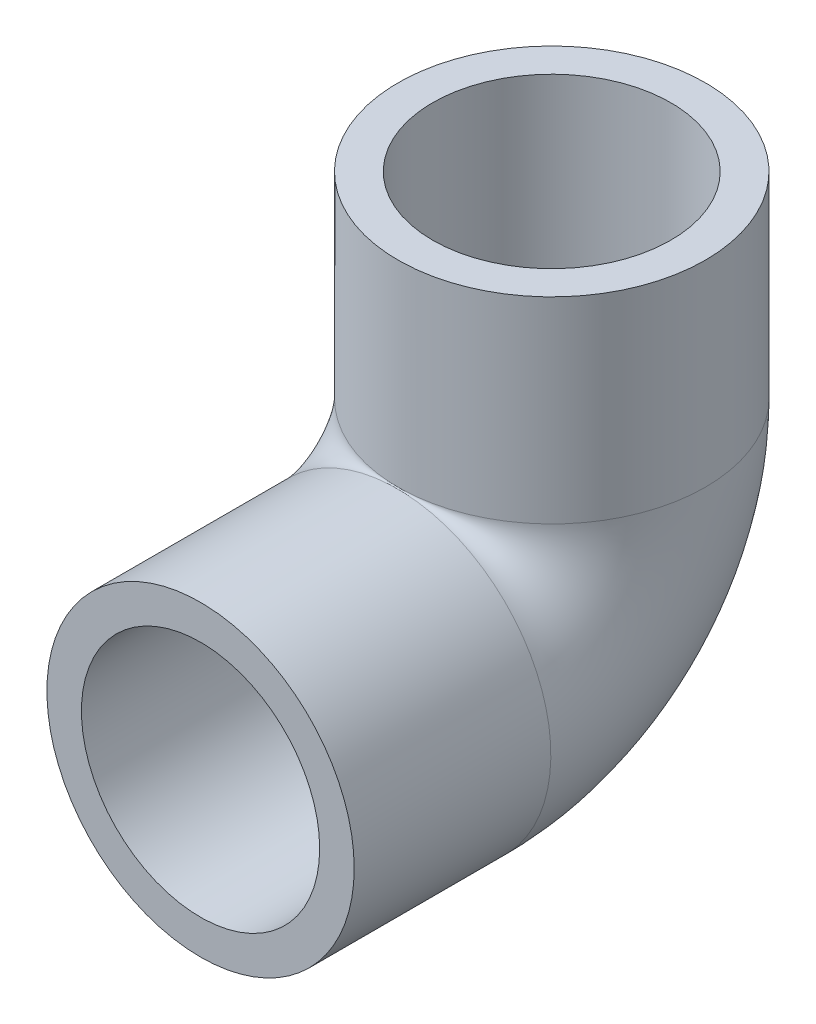
ISO-10303-21;
HEADER;
FILE_DESCRIPTION(('STEP AP214'),'2;1');
FILE_NAME('part.step','',(''),(''),'','','');
FILE_SCHEMA(('AUTOMOTIVE_DESIGN { 1 0 10303 214 1 1 1 1 }'));
ENDSEC;
DATA;
#1=APPLICATION_CONTEXT('core data for automotive mechanical design processes');
#2=APPLICATION_PROTOCOL_DEFINITION('international standard','automotive_design',2000,#1);
#3=PRODUCT_CONTEXT('',#1,'mechanical');
#4=PRODUCT('Part','Part','',(#3));
#5=PRODUCT_RELATED_PRODUCT_CATEGORY('part','',(#4));
#6=PRODUCT_DEFINITION_FORMATION('','',#4);
#7=PRODUCT_DEFINITION_CONTEXT('part definition',#1,'design');
#8=PRODUCT_DEFINITION('design','',#6,#7);
#9=PRODUCT_DEFINITION_SHAPE('','',#8);
#10=(LENGTH_UNIT() NAMED_UNIT(*) SI_UNIT(.MILLI.,.METRE.));
#11=(NAMED_UNIT(*) PLANE_ANGLE_UNIT() SI_UNIT($,.RADIAN.));
#12=(NAMED_UNIT(*) SI_UNIT($,.STERADIAN.) SOLID_ANGLE_UNIT());
#13=UNCERTAINTY_MEASURE_WITH_UNIT(LENGTH_MEASURE(1.E-05),#10,'distance_accuracy_value','');
#14=(GEOMETRIC_REPRESENTATION_CONTEXT(3) GLOBAL_UNCERTAINTY_ASSIGNED_CONTEXT((#13)) GLOBAL_UNIT_ASSIGNED_CONTEXT((#10,
#11,#12)) REPRESENTATION_CONTEXT('',''));
#15=CARTESIAN_POINT('',(0.,0.,0.));
#16=DIRECTION('',(0.,0.,1.));
#17=DIRECTION('',(1.,0.,0.));
#18=AXIS2_PLACEMENT_3D('',#15,#16,#17);
#19=CARTESIAN_POINT('',(0.,13.97,-17.78));
#20=DIRECTION('',(1.,0.,0.));
#21=DIRECTION('',(0.,0.,-1.));
#22=AXIS2_PLACEMENT_3D('',#19,#20,#21);
#23=TOROIDAL_SURFACE('',#22,13.97,8.89);
#24=CARTESIAN_POINT('',(-6.37844074945994,-6.15250620204619,-19.05));
#25=CARTESIAN_POINT('',(-6.55265358811134,-5.97270897004341,-19.05));
#26=CARTESIAN_POINT('',(-6.71924963325663,-5.78557069902349,-19.05));
#27=CARTESIAN_POINT('',(-7.036126640922,-5.39785408510035,-19.05));
#28=CARTESIAN_POINT('',(-7.18640319357505,-5.1972721329966,-19.05));
#29=CARTESIAN_POINT('',(-7.4696691497037,-4.78393540811667,-19.05));
#30=CARTESIAN_POINT('',(-7.60263955128776,-4.57116761836567,-19.05));
#31=CARTESIAN_POINT('',(-7.85017068423849,-4.13517535821175,-19.05));
#32=CARTESIAN_POINT('',(-7.96473115637433,-3.91195074062304,-19.05));
#33=CARTESIAN_POINT('',(-8.17457283771716,-3.45678497671088,-19.05));
#34=CARTESIAN_POINT('',(-8.26986592369114,-3.22484930524622,-19.05));
#35=CARTESIAN_POINT('',(-8.44060317279692,-2.75378003626996,-19.05));
#36=CARTESIAN_POINT('',(-8.5160470252719,-2.51464632616842,-19.05));
#37=CARTESIAN_POINT('',(-8.64653958838355,-2.0309899566447,-19.05));
#38=CARTESIAN_POINT('',(-8.70159716753797,-1.78646968966845,-19.05));
#39=CARTESIAN_POINT('',(-8.79101136260539,-1.29358617762446,-19.05));
#40=CARTESIAN_POINT('',(-8.82536079059621,-1.04522162882963,-19.05));
#41=CARTESIAN_POINT('',(-8.87316358347558,-0.545932697635167,-19.05));
#42=CARTESIAN_POINT('',(-8.88657032999845,-0.295003852305892,-19.05));
#43=CARTESIAN_POINT('',(-8.8922734770001,0.20709782060306,-19.05));
#44=CARTESIAN_POINT('',(-8.88456944479688,0.458270653077971,-19.05));
#45=CARTESIAN_POINT('',(-8.84813304169755,0.959094117650891,-19.05));
#46=CARTESIAN_POINT('',(-8.81939996889569,1.20874469865884,-19.05));
#47=CARTESIAN_POINT('',(-8.74113697253112,1.70476976699208,-19.05));
#48=CARTESIAN_POINT('',(-8.69160651997203,1.95114417082098,-19.05));
#49=CARTESIAN_POINT('',(-8.57185451013886,2.44000702483937,-19.05));
#50=CARTESIAN_POINT('',(-8.50153935408703,2.68247254800679,-19.05));
#51=CARTESIAN_POINT('',(-8.34080660892054,3.16073310754644,-19.05));
#52=CARTESIAN_POINT('',(-8.25038247233881,3.39652594304511,-19.05));
#53=CARTESIAN_POINT('',(-8.05012647106405,3.85967984029267,-19.05));
#54=CARTESIAN_POINT('',(-7.94029739824587,4.08704210929917,-19.05));
#55=CARTESIAN_POINT('',(-7.70201980419061,4.53179156443763,-19.05));
#56=CARTESIAN_POINT('',(-7.57357116501662,4.74917868737522,-19.05));
#57=CARTESIAN_POINT('',(-7.29811067153746,5.17380045370301,-19.05));
#58=CARTESIAN_POINT('',(-7.150987300397,5.38096276182464,-19.05));
#59=CARTESIAN_POINT('',(-6.83991870902255,5.78214057197237,-19.05));
#60=CARTESIAN_POINT('',(-6.67597886392806,5.97616024213086,-19.05));
#61=CARTESIAN_POINT('',(-6.33234691783932,6.34980727003259,-19.05));
#62=CARTESIAN_POINT('',(-6.15265054487344,6.5294306991874,-19.05));
#63=CARTESIAN_POINT('',(-5.77880097090272,6.87293620301891,-19.05));
#64=CARTESIAN_POINT('',(-5.58464810212479,7.03681863924366,-19.05));
#65=CARTESIAN_POINT('',(-5.18258024855418,7.34814123361896,-19.05));
#66=CARTESIAN_POINT('',(-4.97462322043498,7.49552710854928,-19.05));
#67=CARTESIAN_POINT('',(-4.54695287018983,7.77211184423889,-19.05));
#68=CARTESIAN_POINT('',(-4.32723990730704,7.90131126031062,-19.05));
#69=CARTESIAN_POINT('',(-3.87754569675702,8.1404939788153,-19.05));
#70=CARTESIAN_POINT('',(-3.6475629283226,8.25047442334923,-19.05));
#71=CARTESIAN_POINT('',(-3.17907398707908,8.45019120132642,-19.05));
#72=CARTESIAN_POINT('',(-2.94057134415004,8.53993580855791,-19.05));
#73=CARTESIAN_POINT('',(-2.45987084940879,8.69733663913599,-19.05));
#74=CARTESIAN_POINT('',(-2.21776345883891,8.76526904414771,-19.05));
#75=CARTESIAN_POINT('',(-1.72858098729408,8.87996111423802,-19.05));
#76=CARTESIAN_POINT('',(-1.48150595985033,8.92672100734367,-19.05));
#77=CARTESIAN_POINT('',(-0.984285212546029,8.99855256067346,-19.05));
#78=CARTESIAN_POINT('',(-0.734140301182061,9.02362981207311,-19.05));
#79=CARTESIAN_POINT('',(-0.232617894754403,9.05182982779911,-19.05));
#80=CARTESIAN_POINT('',(0.018759571860313,9.054953096487,-19.05));
#81=CARTESIAN_POINT('',(0.513353804620188,9.03944560482782,-19.05));
#82=CARTESIAN_POINT('',(0.756591027849455,9.02145875112137,-19.05));
#83=CARTESIAN_POINT('',(1.24066784103208,8.96498140671673,-19.05));
#84=CARTESIAN_POINT('',(1.48150747679653,8.92649130854625,-19.05));
#85=CARTESIAN_POINT('',(1.95907619949638,8.82941171345989,-19.05));
#86=CARTESIAN_POINT('',(2.19580561370827,8.7708238246136,-19.05));
#87=CARTESIAN_POINT('',(2.66364052660021,8.63409328400183,-19.05));
#88=CARTESIAN_POINT('',(2.89474386168033,8.55594323567732,-19.05));
#89=CARTESIAN_POINT('',(3.35016692003279,8.3806217818884,-19.05));
#90=CARTESIAN_POINT('',(3.57447152643576,8.28341113294343,-19.05));
#91=CARTESIAN_POINT('',(4.0144087358547,8.0708447322389,-19.05));
#92=CARTESIAN_POINT('',(4.23003811332067,7.95548230831805,-19.05));
#93=CARTESIAN_POINT('',(4.65108292851164,7.70757175378529,-19.05));
#94=CARTESIAN_POINT('',(4.85650164906419,7.57502919685121,-19.05));
#95=CARTESIAN_POINT('',(5.25597905150216,7.29363102751744,-19.05));
#96=CARTESIAN_POINT('',(5.45003252152679,7.144768019393,-19.05));
#97=CARTESIAN_POINT('',(5.83100867687358,6.82716794535048,-19.05));
#98=CARTESIAN_POINT('',(6.01754953209855,6.65797259770887,-19.05));
#99=CARTESIAN_POINT('',(6.37581926745785,6.30471539210296,-19.05));
#100=CARTESIAN_POINT('',(6.54755437928516,6.12065985254199,-19.05));
#101=CARTESIAN_POINT('',(6.87519507790134,5.73881857616719,-19.05));
#102=CARTESIAN_POINT('',(7.03109363309841,5.54102680538322,-19.05));
#103=CARTESIAN_POINT('',(7.32583667873847,5.13322537015793,-19.05));
#104=CARTESIAN_POINT('',(7.46468704196691,4.92321995003754,-19.05));
#105=CARTESIAN_POINT('',(7.72600879668106,4.48973454552875,-19.05));
#106=CARTESIAN_POINT('',(7.84825882848079,4.26612106176459,-19.05));
#107=CARTESIAN_POINT('',(8.07344693594014,3.8093762938715,-19.05));
#108=CARTESIAN_POINT('',(8.17638525534277,3.5762451299153,-19.05));
#109=CARTESIAN_POINT('',(8.36218859933833,3.10210862147539,-19.05));
#110=CARTESIAN_POINT('',(8.44505313408284,2.86110308500096,-19.05));
#111=CARTESIAN_POINT('',(8.59007655851628,2.37294516206827,-19.05));
#112=CARTESIAN_POINT('',(8.65223588785182,2.12579290624693,-19.05));
#113=CARTESIAN_POINT('',(8.75521024407407,1.6278799019722,-19.05));
#114=CARTESIAN_POINT('',(8.79609083571064,1.37713271369474,-19.05));
#115=CARTESIAN_POINT('',(8.85646205137526,0.873165387976139,-19.05));
#116=CARTESIAN_POINT('',(8.87596023919226,0.619946156992454,-19.05));
#117=CARTESIAN_POINT('',(8.89342225171104,0.112726527647214,-19.05));
#118=CARTESIAN_POINT('',(8.89138276368565,-0.141273984877296,-19.05));
#119=CARTESIAN_POINT('',(8.86574700201337,-0.648184928173761,-19.05));
#120=CARTESIAN_POINT('',(8.84215082340086,-0.901095363746468,-19.05));
#121=CARTESIAN_POINT('',(8.77375583078849,-1.4024593494625,-19.05));
#122=CARTESIAN_POINT('',(8.72908732816365,-1.65093068201252,-19.05));
#123=CARTESIAN_POINT('',(8.61889563933159,-2.14320488925253,-19.05));
#124=CARTESIAN_POINT('',(8.55337256671114,-2.38700778936201,-19.05));
#125=CARTESIAN_POINT('',(8.4019227474812,-2.86818683650978,-19.05));
#126=CARTESIAN_POINT('',(8.31599639652777,-3.10556310807248,-19.05));
#127=CARTESIAN_POINT('',(8.12433901929039,-3.57218140863061,-19.05));
#128=CARTESIAN_POINT('',(8.01860804283899,-3.80142345809171,-19.05));
#129=CARTESIAN_POINT('',(7.7886502619659,-4.249020832057,-19.05));
#130=CARTESIAN_POINT('',(7.66451620317844,-4.46742381037555,-19.05));
#131=CARTESIAN_POINT('',(7.39820215299085,-4.89304158433434,-19.05));
#132=CARTESIAN_POINT('',(7.25601593671676,-5.10025248534216,-19.05));
#133=CARTESIAN_POINT('',(6.9546673064269,-5.50187538709932,-19.05));
#134=CARTESIAN_POINT('',(6.79550821560564,-5.69628988130267,-19.05));
#135=CARTESIAN_POINT('',(6.46131821985327,-6.07096912852214,-19.05));
#136=CARTESIAN_POINT('',(6.28628702440131,-6.25123362242587,-19.05));
#137=CARTESIAN_POINT('',(5.9221582378114,-6.59578453294764,-19.05));
#138=CARTESIAN_POINT('',(5.73310507894826,-6.76011790897933,-19.05));
#139=CARTESIAN_POINT('',(5.3418040006315,-7.07225156348138,-19.05));
#140=CARTESIAN_POINT('',(5.13955583215232,-7.22005152977852,-19.05));
#141=CARTESIAN_POINT('',(4.72331005112464,-7.4980521459467,-19.05));
#142=CARTESIAN_POINT('',(4.50931262725675,-7.6282530783234,-19.05));
#143=CARTESIAN_POINT('',(4.07108987538269,-7.87012379351695,-19.05));
#144=CARTESIAN_POINT('',(3.84686456269063,-7.9817936040791,-19.05));
#145=CARTESIAN_POINT('',(3.39018408282369,-8.18562219347568,-19.05));
#146=CARTESIAN_POINT('',(3.15774395393405,-8.27781466717863,-19.05));
#147=CARTESIAN_POINT('',(2.68592346418781,-8.44227227142287,-19.05));
#148=CARTESIAN_POINT('',(2.44654325734194,-8.51453784379845,-19.05));
#149=CARTESIAN_POINT('',(1.96254739975653,-8.63862526577819,-19.05));
#150=CARTESIAN_POINT('',(1.71793187029656,-8.6904475884239,-19.05));
#151=CARTESIAN_POINT('',(1.22520727081707,-8.77327878407377,-19.05));
#152=CARTESIAN_POINT('',(0.977098276439946,-8.8042881070268,-19.05));
#153=CARTESIAN_POINT('',(0.479350065306444,-8.84525639351295,-19.05));
#154=CARTESIAN_POINT('',(0.229712244545157,-8.85523231932335,-19.05));
#155=CARTESIAN_POINT('',(-0.269429523398658,-8.85411317088767,-19.05));
#156=CARTESIAN_POINT('',(-0.518933486985621,-8.84302540228637,-19.05));
#157=CARTESIAN_POINT('',(-1.0162277586702,-8.79986321521925,-19.05));
#158=CARTESIAN_POINT('',(-1.26401728343827,-8.76777977101511,-19.05));
#159=CARTESIAN_POINT('',(-1.75600745580795,-8.68284773649598,-19.05));
#160=CARTESIAN_POINT('',(-2.00020816039615,-8.62999947627432,-19.05));
#161=CARTESIAN_POINT('',(-2.48336396148331,-8.50389590252119,-19.05));
#162=CARTESIAN_POINT('',(-2.72231740052259,-8.43063423823628,-19.05));
#163=CARTESIAN_POINT('',(-3.19319699310001,-8.26423683857388,-19.05));
#164=CARTESIAN_POINT('',(-3.42512322920915,-8.17110133682135,-19.05));
#165=CARTESIAN_POINT('',(-3.88006187865779,-7.96572938994331,-19.05));
#166=CARTESIAN_POINT('',(-4.10308362283978,-7.85351362381503,-19.05));
#167=CARTESIAN_POINT('',(-4.53882480249673,-7.61075693695441,-19.05));
#168=CARTESIAN_POINT('',(-4.75154695631042,-7.48022088728832,-19.05));
#169=CARTESIAN_POINT('',(-5.21487975933969,-7.16831067332331,-19.05));
#170=CARTESIAN_POINT('',(-5.4623537840472,-6.98225002895641,-19.05));
#171=CARTESIAN_POINT('',(-5.93657033226603,-6.58535970375744,-19.05));
#172=CARTESIAN_POINT('',(-6.16331285507396,-6.37453002208499,-19.05));
#173=CARTESIAN_POINT('',(-6.37844074945994,-6.15250620204619,-19.05));
#174=B_SPLINE_CURVE_WITH_KNOTS('',3,(#24,#25,#26,#27,#28,#29,#30,#31,#32,#33,#34,#35,#36,#37,
#38,#39,#40,#41,#42,#43,#44,#45,#46,#47,#48,#49,#50,#51,#52,#53,#54,#55,#56,#57,#58,#59,#60,#61,
#62,#63,#64,#65,#66,#67,#68,#69,#70,#71,#72,#73,#74,#75,#76,#77,#78,#79,#80,#81,#82,#83,#84,#85,
#86,#87,#88,#89,#90,#91,#92,#93,#94,#95,#96,#97,#98,#99,#100,#101,#102,#103,#104,#105,#106,#107,
#108,#109,#110,#111,#112,#113,#114,#115,#116,#117,#118,#119,#120,#121,#122,#123,#124,#125,#126,
#127,#128,#129,#130,#131,#132,#133,#134,#135,#136,#137,#138,#139,#140,#141,#142,#143,#144,#145,
#146,#147,#148,#149,#150,#151,#152,#153,#154,#155,#156,#157,#158,#159,#160,#161,#162,#163,#164,
#165,#166,#167,#168,#169,#170,#171,#172,#173),.UNSPECIFIED.,.T.,.F.,(4,2,2,2,2,2,2,2,2,2,2,2,2,
2,2,2,2,2,2,2,2,2,2,2,2,2,2,2,2,2,2,2,2,2,2,2,2,2,2,2,2,2,2,2,2,2,2,2,2,2,2,2,2,2,2,2,2,2,2,2,2,
2,2,2,2,2,2,2,2,2,2,2,2,2,4),(0.,0.750790938646044,1.50178425445916,2.25359531544322,
3.00541696177633,3.75677374914059,4.50814229515696,5.25918359274094,6.01048543134633,
6.7634572951457,7.5164445918104,8.26945702277473,9.02248860831486,9.77896433391011,
10.5356867289291,11.292300339442,12.0489187425777,12.8102889616309,13.5714165737231,
14.3327511875942,15.0940683105167,15.8578212031448,16.621550769983,17.3853938084543,
18.148923967267,18.9023657661011,19.6557994502055,20.4090387927976,21.1622608307303,
21.8930923737279,22.6239099257045,23.354669016953,24.085704830662,24.8182618700711,
25.5510888118136,26.2836785979047,27.0166017451106,27.7712484166429,28.52557589297,
29.2802368476909,30.0346371019781,30.7982742226557,31.5619017044297,32.3255478186662,
33.0891777168923,33.850440553227,34.6114340142998,35.3725445260912,36.1336516824828,
36.8901126397826,37.6465694770027,38.4030116463693,39.1594519123958,39.9122019866425,
40.6652123381472,41.4180755241664,42.1709524932742,42.9215380860812,43.6721378485717,
44.422725560749,45.1733121491155,45.922589428826,46.6718500936596,47.421093420143,
48.1703205484782,48.918943234899,49.6673063195225,50.4159913261705,51.1646644316327,
51.9135707151195,52.6624681953969,53.4105591421628,54.1584515591794,55.0855707630525,
56.0126899983817),.UNSPECIFIED.);
#175=CARTESIAN_POINT('',(-6.37844074945994,-6.15250620204619,-19.05));
#176=VERTEX_POINT('',#175);
#177=EDGE_CURVE('E70',#176,#176,#174,.T.);
#178=ORIENTED_EDGE('',*,*,#177,.F.);
#179=EDGE_LOOP('',(#178));
#180=FACE_BOUND('',#179,.T.);
#181=CARTESIAN_POINT('',(-6.37844074945994,12.7,-37.9025062020462));
#182=CARTESIAN_POINT('',(-6.20474073709434,12.7,-38.0817792957849));
#183=CARTESIAN_POINT('',(-6.0235087976217,12.7,-38.2537124055026));
#184=CARTESIAN_POINT('',(-5.64716302998535,12.7,-38.5817769940014));
#185=CARTESIAN_POINT('',(-5.45204562030667,12.7,-38.7379043706284));
#186=CARTESIAN_POINT('',(-5.04915061627362,12.7,-39.0333321411681));
#187=CARTESIAN_POINT('',(-4.84135989516141,12.7,-39.1726146264416));
#188=CARTESIAN_POINT('',(-4.41477368993109,12.7,-39.433170131034));
#189=CARTESIAN_POINT('',(-4.19597808347778,12.7,-39.5544429500901));
#190=CARTESIAN_POINT('',(-3.74903958943639,12.7,-39.7780581660568));
#191=CARTESIAN_POINT('',(-3.52090088632464,12.7,-39.8804089267105));
#192=CARTESIAN_POINT('',(-3.05680349580103,12.7,-40.0655155332791));
#193=CARTESIAN_POINT('',(-2.82084468574288,12.7,-40.1482710717074));
#194=CARTESIAN_POINT('',(-2.34289167599953,12.7,-40.2935614560021));
#195=CARTESIAN_POINT('',(-2.10090009173362,12.7,-40.3561049057846));
#196=CARTESIAN_POINT('',(-1.61242157983067,12.7,-40.4605898402983));
#197=CARTESIAN_POINT('',(-1.3659331256477,12.7,-40.5025241886546));
#198=CARTESIAN_POINT('',(-0.870489184670927,12.7,-40.5654338652966));
#199=CARTESIAN_POINT('',(-0.621535745595367,12.7,-40.5864253215515));
#200=CARTESIAN_POINT('',(-0.122741566933002,12.7,-40.6073557925204));
#201=CARTESIAN_POINT('',(0.127099186148634,12.7,-40.6072944856678));
#202=CARTESIAN_POINT('',(0.625891097590026,12.7,-40.5861188713894));
#203=CARTESIAN_POINT('',(0.874842240845922,12.7,-40.5650042082066));
#204=CARTESIAN_POINT('',(1.37008539512523,12.7,-40.5018716888228));
#205=CARTESIAN_POINT('',(1.61637734738953,12.7,-40.4598533716836));
#206=CARTESIAN_POINT('',(2.1044293170605,12.7,-40.3552386945175));
#207=CARTESIAN_POINT('',(2.34619142344864,12.7,-40.2926520796028));
#208=CARTESIAN_POINT('',(2.82366922675673,12.7,-40.1473175123827));
#209=CARTESIAN_POINT('',(3.05938280260471,12.7,-40.0645625915159));
#210=CARTESIAN_POINT('',(3.5229598153192,12.7,-39.8795111395284));
#211=CARTESIAN_POINT('',(3.75082468389451,12.7,-39.7772181949251));
#212=CARTESIAN_POINT('',(4.19713685497514,12.7,-39.5538096630043));
#213=CARTESIAN_POINT('',(4.41558400365184,12.7,-39.4326937683821));
#214=CARTESIAN_POINT('',(4.8415873005519,12.7,-39.1724571094743));
#215=CARTESIAN_POINT('',(5.04913940033824,12.7,-39.0333297180226));
#216=CARTESIAN_POINT('',(5.45180028244198,12.7,-38.7380949022095));
#217=CARTESIAN_POINT('',(5.64690878894619,12.7,-38.5819871016833));
#218=CARTESIAN_POINT('',(6.02326316322017,12.7,-38.2539380283375));
#219=CARTESIAN_POINT('',(6.20451157875892,12.7,-38.0819996783668));
#220=CARTESIAN_POINT('',(6.55196745278297,12.7,-37.7234280866016));
#221=CARTESIAN_POINT('',(6.71816967335151,12.7,-37.5367897693803));
#222=CARTESIAN_POINT('',(7.03444274969991,12.7,-37.1500158998863));
#223=CARTESIAN_POINT('',(7.18449813143022,12.7,-36.9498676942762));
#224=CARTESIAN_POINT('',(7.46724212310746,12.7,-36.5376584596463));
#225=CARTESIAN_POINT('',(7.59993067227849,12.7,-36.3255973889406));
#226=CARTESIAN_POINT('',(7.84701080565711,12.7,-35.8910745755146));
#227=CARTESIAN_POINT('',(7.96140258144516,12.7,-35.6686129417273));
#228=CARTESIAN_POINT('',(8.1710983630706,12.7,-35.2148612313877));
#229=CARTESIAN_POINT('',(8.26640181955319,12.7,-34.9835709009768));
#230=CARTESIAN_POINT('',(8.43743896775936,12.7,-34.5133151631004));
#231=CARTESIAN_POINT('',(8.5131312318249,12.7,-34.2743346878905));
#232=CARTESIAN_POINT('',(8.64416488697847,12.7,-33.7908656241887));
#233=CARTESIAN_POINT('',(8.69950680878382,12.7,-33.5463771795159));
#234=CARTESIAN_POINT('',(8.78947380661776,12.7,-33.0536133115813));
#235=CARTESIAN_POINT('',(8.82409846625042,12.7,-32.8053378123064));
#236=CARTESIAN_POINT('',(8.87240916367957,12.7,-32.3067579915974));
#237=CARTESIAN_POINT('',(8.88609512488861,12.7,-32.0564536627458));
#238=CARTESIAN_POINT('',(8.89246997582945,12.7,-31.554668346044));
#239=CARTESIAN_POINT('',(8.88508242456253,12.7,-31.3031863864113));
#240=CARTESIAN_POINT('',(8.84923329663098,12.7,-30.8018158880889));
#241=CARTESIAN_POINT('',(8.82077885824088,12.7,-30.5519268385802));
#242=CARTESIAN_POINT('',(8.7430280663783,12.7,-30.0553626930809));
#243=CARTESIAN_POINT('',(8.69372760843241,12.7,-29.8086882398927));
#244=CARTESIAN_POINT('',(8.57466418543991,12.7,-29.3203343230176));
#245=CARTESIAN_POINT('',(8.50490159540744,12.7,-29.0786547678749));
#246=CARTESIAN_POINT('',(8.34501792721449,12.7,-28.6007235994342));
#247=CARTESIAN_POINT('',(8.2547925654749,12.7,-28.3645068702173));
#248=CARTESIAN_POINT('',(8.05485969419668,12.7,-27.9004713398257));
#249=CARTESIAN_POINT('',(7.94515235905419,12.7,-27.6726524634983));
#250=CARTESIAN_POINT('',(7.70702892792619,12.7,-27.2269509351295));
#251=CARTESIAN_POINT('',(7.57860892885154,12.7,-27.009070368501));
#252=CARTESIAN_POINT('',(7.30404637360189,12.7,-26.5848836054206));
#253=CARTESIAN_POINT('',(7.15790982430748,12.7,-26.3785735204493));
#254=CARTESIAN_POINT('',(6.847945606322,12.7,-25.9776299639012));
#255=CARTESIAN_POINT('',(6.68401293572348,12.7,-25.7830776567558));
#256=CARTESIAN_POINT('',(6.3403773125182,12.7,-25.408445327075));
#257=CARTESIAN_POINT('',(6.16067466254245,12.7,-25.228365026944));
#258=CARTESIAN_POINT('',(5.78672755952672,12.7,-24.8839417404848));
#259=CARTESIAN_POINT('',(5.59248120295244,12.7,-24.7196008206232));
#260=CARTESIAN_POINT('',(5.19081869016024,12.7,-24.4078969101419));
#261=CARTESIAN_POINT('',(4.98340286445328,12.7,-24.2605334937031));
#262=CARTESIAN_POINT('',(4.55663519207021,12.7,-23.9837833884197));
#263=CARTESIAN_POINT('',(4.33727270453344,12.7,-23.8544131028435));
#264=CARTESIAN_POINT('',(3.88839445014319,12.7,-23.6149058000806));
#265=CARTESIAN_POINT('',(3.65888272429197,12.7,-23.5047612129206));
#266=CARTESIAN_POINT('',(3.19122962946149,12.7,-23.3046009022121));
#267=CARTESIAN_POINT('',(2.95308798376286,12.7,-23.2145858247834));
#268=CARTESIAN_POINT('',(2.46989477701372,12.7,-23.0555444010504));
#269=CARTESIAN_POINT('',(2.22484337286445,12.7,-22.9865175785803));
#270=CARTESIAN_POINT('',(1.7344523278292,12.7,-22.8712932840267));
#271=CARTESIAN_POINT('',(1.48921076832092,12.7,-22.8246783628697));
#272=CARTESIAN_POINT('',(0.995616029352046,12.7,-22.7528089567762));
#273=CARTESIAN_POINT('',(0.747262897107208,12.7,-22.7275541481136));
#274=CARTESIAN_POINT('',(0.249345921232905,12.7,-22.6986906987125));
#275=CARTESIAN_POINT('',(-0.00021769719567847,12.7,-22.6950781753614));
#276=CARTESIAN_POINT('',(-0.498714030835583,12.7,-22.7095307245631));
#277=CARTESIAN_POINT('',(-0.74764675504395,12.7,-22.7275954862176));
#278=CARTESIAN_POINT('',(-1.23638014411826,12.7,-22.7844244677845));
#279=CARTESIAN_POINT('',(-1.47624696701141,12.7,-22.82262206295));
#280=CARTESIAN_POINT('',(-1.95193518554062,12.7,-22.9189586491655));
#281=CARTESIAN_POINT('',(-2.18775665419066,12.7,-22.9770972799043));
#282=CARTESIAN_POINT('',(-2.65374178820821,12.7,-23.1127504529645));
#283=CARTESIAN_POINT('',(-2.88390572192769,12.7,-23.1902640743229));
#284=CARTESIAN_POINT('',(-3.33715203088597,12.7,-23.364007360716));
#285=CARTESIAN_POINT('',(-3.56023168959982,12.7,-23.4602441068485));
#286=CARTESIAN_POINT('',(-4.00068164047451,12.7,-23.6720166714738));
#287=CARTESIAN_POINT('',(-4.2179370310439,12.7,-23.7877914340076));
#288=CARTESIAN_POINT('',(-4.64228209740587,12.7,-24.0368666412185));
#289=CARTESIAN_POINT('',(-4.84936723823012,12.7,-24.1701748084153));
#290=CARTESIAN_POINT('',(-5.25189811170459,12.7,-24.4532709742388));
#291=CARTESIAN_POINT('',(-5.44734566644225,12.7,-24.6030563825247));
#292=CARTESIAN_POINT('',(-5.82537330930383,12.7,-24.9180703152201));
#293=CARTESIAN_POINT('',(-6.007953173722,12.7,-25.0832991079979));
#294=CARTESIAN_POINT('',(-6.36392673901389,12.7,-25.4328583599551));
#295=CARTESIAN_POINT('',(-6.53692527033766,12.7,-25.6175914767548));
#296=CARTESIAN_POINT('',(-6.86686717130566,12.7,-26.0008726616443));
#297=CARTESIAN_POINT('',(-7.02381069953958,12.7,-26.1994205932402));
#298=CARTESIAN_POINT('',(-7.32055232060283,12.7,-26.6089611621961));
#299=CARTESIAN_POINT('',(-7.46034929540587,12.7,-26.8199546097282));
#300=CARTESIAN_POINT('',(-7.72178664632811,12.7,-27.2529013290225));
#301=CARTESIAN_POINT('',(-7.84342728090795,12.7,-27.4748544447107));
#302=CARTESIAN_POINT('',(-8.06847027536813,12.7,-27.9297848970168));
#303=CARTESIAN_POINT('',(-8.17173729293923,12.7,-28.1628292059578));
#304=CARTESIAN_POINT('',(-8.35816556738938,12.7,-28.6367329544648));
#305=CARTESIAN_POINT('',(-8.44133376732128,12.7,-28.8775896625654));
#306=CARTESIAN_POINT('',(-8.58699115643763,12.7,-29.3655122230979));
#307=CARTESIAN_POINT('',(-8.64947763678314,12.7,-29.6125788843375));
#308=CARTESIAN_POINT('',(-8.75327268245418,12.7,-30.1111209609941));
#309=CARTESIAN_POINT('',(-8.79458138871771,12.7,-30.3625963470597));
#310=CARTESIAN_POINT('',(-8.85553994668163,12.7,-30.8669048042411));
#311=CARTESIAN_POINT('',(-8.87529520639341,12.7,-31.1197251359195));
#312=CARTESIAN_POINT('',(-8.89333529921488,12.7,-31.6261317801095));
#313=CARTESIAN_POINT('',(-8.89162013854258,12.7,-31.8797180923992));
#314=CARTESIAN_POINT('',(-8.86669974831598,12.7,-32.3858927068961));
#315=CARTESIAN_POINT('',(-8.84348949267714,12.7,-32.6384807618133));
#316=CARTESIAN_POINT('',(-8.77571331348422,12.7,-33.1407712442361));
#317=CARTESIAN_POINT('',(-8.73114781214857,12.7,-33.390473728693));
#318=CARTESIAN_POINT('',(-8.62125836263863,12.7,-33.8838488929583));
#319=CARTESIAN_POINT('',(-8.55604811583731,12.7,-34.1275469003888));
#320=CARTESIAN_POINT('',(-8.40524723499321,12.7,-34.6085472967752));
#321=CARTESIAN_POINT('',(-8.31965706191451,12.7,-34.8458498302521));
#322=CARTESIAN_POINT('',(-8.12879261624476,12.7,-35.3121055637116));
#323=CARTESIAN_POINT('',(-8.02353985263638,12.7,-35.5410675634596));
#324=CARTESIAN_POINT('',(-7.79407205925098,12.7,-35.9891890171027));
#325=CARTESIAN_POINT('',(-7.66986209112909,12.7,-36.2083510674893));
#326=CARTESIAN_POINT('',(-7.37039207334713,12.7,-36.688123885411));
#327=CARTESIAN_POINT('',(-7.19009888631483,12.7,-36.9456126179859));
#328=CARTESIAN_POINT('',(-6.80331949122234,12.7,-37.4401039441508));
#329=CARTESIAN_POINT('',(-6.59683334444279,12.7,-37.6771065856674));
#330=CARTESIAN_POINT('',(-6.37844074945994,12.7,-37.9025062020462));
#331=B_SPLINE_CURVE_WITH_KNOTS('',3,(#181,#182,#183,#184,#185,#186,#187,#188,#189,#190,#191,
#192,#193,#194,#195,#196,#197,#198,#199,#200,#201,#202,#203,#204,#205,#206,#207,#208,#209,#210,
#211,#212,#213,#214,#215,#216,#217,#218,#219,#220,#221,#222,#223,#224,#225,#226,#227,#228,#229,
#230,#231,#232,#233,#234,#235,#236,#237,#238,#239,#240,#241,#242,#243,#244,#245,#246,#247,#248,
#249,#250,#251,#252,#253,#254,#255,#256,#257,#258,#259,#260,#261,#262,#263,#264,#265,#266,#267,
#268,#269,#270,#271,#272,#273,#274,#275,#276,#277,#278,#279,#280,#281,#282,#283,#284,#285,#286,
#287,#288,#289,#290,#291,#292,#293,#294,#295,#296,#297,#298,#299,#300,#301,#302,#303,#304,#305,
#306,#307,#308,#309,#310,#311,#312,#313,#314,#315,#316,#317,#318,#319,#320,#321,#322,#323,#324,
#325,#326,#327,#328,#329,#330),.UNSPECIFIED.,.T.,.F.,(4,2,2,2,2,2,2,2,2,2,2,2,2,2,2,2,2,2,2,2,2,
2,2,2,2,2,2,2,2,2,2,2,2,2,2,2,2,2,2,2,2,2,2,2,2,2,2,2,2,2,2,2,2,2,2,2,2,2,2,2,2,2,2,2,2,2,2,2,2,
2,2,2,2,2,4),(0.,0.748588835138072,1.49737146047884,2.24694328328066,2.99652344049827,
3.74577147931277,4.49503127449141,5.24397170208877,5.9931712851198,6.74179346861925,
7.49042708681553,8.23907335554458,8.98773613310272,9.73604470975876,10.4846122097925,
11.2330424301,11.9814848706062,12.7302034805412,13.4789386801185,14.2275359143038,
14.976392757768,15.7259609813347,16.4755318279741,17.2250948255501,17.9746793921739,
18.7258347405485,19.4769704981257,20.2281213522617,20.9792749538747,21.7331567132454,
22.4867831452158,23.2405580314786,23.9943191040014,24.7520114760379,25.5096970658059,
26.2675409205255,27.0251285395506,27.7874578088451,28.5497724519917,29.3121870447121,
30.0745825108566,30.8376685147233,31.6004533781389,32.3632627220177,33.1260547585615,
33.8740282393719,34.6219903839639,35.3698183405951,36.1176355719182,36.8454491143457,
37.5732495067253,38.3010153107138,39.0290568931386,39.7667505427188,40.5047702015068,
41.2426740036553,41.9805906311534,42.7389712884178,43.4973444537518,44.2557670418983,
45.0141788326547,45.7779646590236,46.5414862603929,47.305107826339,48.0687243103215,
48.8285893207538,49.5884541111233,50.3484966215367,51.1085241056323,51.8644364837391,
52.6203317658395,53.3754049623401,54.1302769026165,55.0714779914264,56.0126768782571),.UNSPECIFIED.);
#332=CARTESIAN_POINT('',(-6.37844074945994,12.7,-37.9025062020462));
#333=VERTEX_POINT('',#332);
#334=EDGE_CURVE('E39',#333,#333,#331,.T.);
#335=ORIENTED_EDGE('',*,*,#334,.F.);
#336=EDGE_LOOP('',(#335));
#337=FACE_BOUND('',#336,.T.);
#338=ADVANCED_FACE('F35',(#180,#337),#23,.F.);
#339=CARTESIAN_POINT('',(0.,0.,0.));
#340=DIRECTION('',(0.,0.,-1.));
#341=DIRECTION('',(-1.,0.,0.));
#342=AXIS2_PLACEMENT_3D('',#339,#340,#341);
#343=CYLINDRICAL_SURFACE('',#342,13.890625);
#344=CARTESIAN_POINT('',(0.,0.,-17.78));
#345=DIRECTION('',(0.,0.,1.));
#346=DIRECTION('',(1.,0.,0.));
#347=AXIS2_PLACEMENT_3D('',#344,#345,#346);
#348=CIRCLE('',#347,13.890625);
#349=CARTESIAN_POINT('',(0.,-13.890625,-17.78));
#350=VERTEX_POINT('',#349);
#351=EDGE_CURVE('E66',#350,#350,#348,.T.);
#352=ORIENTED_EDGE('',*,*,#351,.T.);
#353=EDGE_LOOP('',(#352));
#354=FACE_BOUND('',#353,.T.);
#355=CARTESIAN_POINT('',(0.,0.,0.));
#356=DIRECTION('',(0.,0.,1.));
#357=DIRECTION('',(1.,0.,0.));
#358=AXIS2_PLACEMENT_3D('',#355,#356,#357);
#359=CIRCLE('',#358,13.890625);
#360=CARTESIAN_POINT('',(13.890625,0.,0.));
#361=VERTEX_POINT('',#360);
#362=EDGE_CURVE('E48',#361,#361,#359,.T.);
#363=ORIENTED_EDGE('',*,*,#362,.F.);
#364=EDGE_LOOP('',(#363));
#365=FACE_BOUND('',#364,.T.);
#366=ADVANCED_FACE('F86',(#354,#365),#343,.T.);
#367=CARTESIAN_POINT('',(0.,13.97,-17.78));
#368=DIRECTION('',(1.,0.,0.));
#369=DIRECTION('',(0.,0.,-1.));
#370=AXIS2_PLACEMENT_3D('',#367,#368,#369);
#371=TOROIDAL_SURFACE('',#370,13.97,13.890625);
#372=CARTESIAN_POINT('',(0.,13.97,-31.75));
#373=DIRECTION('',(0.,-1.,0.));
#374=DIRECTION('',(1.,0.,0.));
#375=AXIS2_PLACEMENT_3D('',#372,#373,#374);
#376=CIRCLE('',#375,13.890625);
#377=CARTESIAN_POINT('',(0.,13.97,-45.640625));
#378=VERTEX_POINT('',#377);
#379=EDGE_CURVE('E64',#378,#378,#376,.T.);
#380=CARTESIAN_POINT('',(0.,13.97,-17.78));
#381=DIRECTION('',(1.,0.,0.));
#382=DIRECTION('',(0.,0.,-1.));
#383=AXIS2_PLACEMENT_3D('',#380,#381,#382);
#384=CIRCLE('',#383,27.860625);
#385=EDGE_CURVE('',#350,#378,#384,.T.);
#386=ORIENTED_EDGE('',*,*,#351,.F.);
#387=ORIENTED_EDGE('',*,*,#379,.T.);
#388=ORIENTED_EDGE('',*,*,#385,.T.);
#389=ORIENTED_EDGE('',*,*,#385,.F.);
#390=EDGE_LOOP('',(#386,#388,#387,#389));
#391=FACE_BOUND('',#390,.T.);
#392=ADVANCED_FACE('F61',(#391),#371,.T.);
#393=CARTESIAN_POINT('',(0.,13.97,-31.75));
#394=DIRECTION('',(0.,1.,0.));
#395=DIRECTION('',(0.,0.,1.));
#396=AXIS2_PLACEMENT_3D('',#393,#394,#395);
#397=CYLINDRICAL_SURFACE('',#396,13.890625);
#398=CARTESIAN_POINT('',(0.,31.75,-31.75));
#399=DIRECTION('',(0.,-1.,0.));
#400=DIRECTION('',(1.,0.,0.));
#401=AXIS2_PLACEMENT_3D('',#398,#399,#400);
#402=CIRCLE('',#401,13.890625);
#403=CARTESIAN_POINT('',(13.890625,31.75,-31.75));
#404=VERTEX_POINT('',#403);
#405=EDGE_CURVE('E11',#404,#404,#402,.T.);
#406=ORIENTED_EDGE('',*,*,#405,.T.);
#407=EDGE_LOOP('',(#406));
#408=FACE_BOUND('',#407,.T.);
#409=ORIENTED_EDGE('',*,*,#379,.F.);
#410=EDGE_LOOP('',(#409));
#411=FACE_BOUND('',#410,.T.);
#412=ADVANCED_FACE('F37',(#408,#411),#397,.T.);
#413=CARTESIAN_POINT('',(0.,0.,0.));
#414=DIRECTION('',(0.,0.,1.));
#415=DIRECTION('',(1.,0.,0.));
#416=AXIS2_PLACEMENT_3D('',#413,#414,#415);
#417=PLANE('',#416);
#418=CARTESIAN_POINT('',(0.,0.,0.));
#419=DIRECTION('',(0.,0.,1.));
#420=DIRECTION('',(1.,0.,0.));
#421=AXIS2_PLACEMENT_3D('',#418,#419,#420);
#422=CIRCLE('',#421,10.7696);
#423=CARTESIAN_POINT('',(10.7696,0.,0.));
#424=VERTEX_POINT('',#423);
#425=EDGE_CURVE('E205',#424,#424,#422,.T.);
#426=ORIENTED_EDGE('',*,*,#425,.F.);
#427=EDGE_LOOP('',(#426));
#428=FACE_BOUND('',#427,.T.);
#429=ORIENTED_EDGE('',*,*,#362,.T.);
#430=EDGE_LOOP('',(#429));
#431=FACE_BOUND('',#430,.T.);
#432=ADVANCED_FACE('F60',(#428,#431),#417,.T.);
#433=CARTESIAN_POINT('',(0.,31.75,-31.75));
#434=DIRECTION('',(0.,-1.,0.));
#435=DIRECTION('',(1.,0.,0.));
#436=AXIS2_PLACEMENT_3D('',#433,#434,#435);
#437=PLANE('',#436);
#438=CARTESIAN_POINT('',(0.,31.75,-31.75));
#439=DIRECTION('',(0.,1.,0.));
#440=DIRECTION('',(0.,0.,1.));
#441=AXIS2_PLACEMENT_3D('',#438,#439,#440);
#442=CIRCLE('',#441,10.7696);
#443=CARTESIAN_POINT('',(0.,31.75,-20.9804));
#444=VERTEX_POINT('',#443);
#445=EDGE_CURVE('E199',#444,#444,#442,.T.);
#446=ORIENTED_EDGE('',*,*,#445,.F.);
#447=EDGE_LOOP('',(#446));
#448=FACE_BOUND('',#447,.T.);
#449=ORIENTED_EDGE('',*,*,#405,.F.);
#450=EDGE_LOOP('',(#449));
#451=FACE_BOUND('',#450,.T.);
#452=ADVANCED_FACE('F56',(#448,#451),#437,.F.);
#453=CARTESIAN_POINT('',(0.,0.,-19.05));
#454=DIRECTION('',(0.,0.,1.));
#455=DIRECTION('',(1.,0.,0.));
#456=AXIS2_PLACEMENT_3D('',#453,#454,#455);
#457=PLANE('',#456);
#458=CARTESIAN_POINT('',(0.,0.,-19.05));
#459=DIRECTION('',(0.,0.,1.));
#460=DIRECTION('',(1.,0.,0.));
#461=AXIS2_PLACEMENT_3D('',#458,#459,#460);
#462=CIRCLE('',#461,10.7696);
#463=CARTESIAN_POINT('',(10.7696,0.,-19.05));
#464=VERTEX_POINT('',#463);
#465=EDGE_CURVE('E76',#464,#464,#462,.T.);
#466=ORIENTED_EDGE('',*,*,#465,.T.);
#467=EDGE_LOOP('',(#466));
#468=FACE_BOUND('',#467,.T.);
#469=ORIENTED_EDGE('',*,*,#177,.T.);
#470=EDGE_LOOP('',(#469));
#471=FACE_BOUND('',#470,.T.);
#472=ADVANCED_FACE('F80',(#468,#471),#457,.T.);
#473=CARTESIAN_POINT('',(0.,0.,-19.05));
#474=DIRECTION('',(0.,0.,1.));
#475=DIRECTION('',(1.,0.,0.));
#476=AXIS2_PLACEMENT_3D('',#473,#474,#475);
#477=CYLINDRICAL_SURFACE('',#476,10.7696);
#478=ORIENTED_EDGE('',*,*,#465,.F.);
#479=EDGE_LOOP('',(#478));
#480=FACE_BOUND('',#479,.T.);
#481=ORIENTED_EDGE('',*,*,#425,.T.);
#482=EDGE_LOOP('',(#481));
#483=FACE_BOUND('',#482,.T.);
#484=ADVANCED_FACE('F84',(#480,#483),#477,.F.);
#485=CARTESIAN_POINT('',(0.,12.7,-31.75));
#486=DIRECTION('',(0.,1.,0.));
#487=DIRECTION('',(0.,0.,1.));
#488=AXIS2_PLACEMENT_3D('',#485,#486,#487);
#489=PLANE('',#488);
#490=CARTESIAN_POINT('',(0.,12.7,-31.75));
#491=DIRECTION('',(0.,1.,0.));
#492=DIRECTION('',(0.,0.,1.));
#493=AXIS2_PLACEMENT_3D('',#490,#491,#492);
#494=CIRCLE('',#493,10.7696);
#495=CARTESIAN_POINT('',(0.,12.7,-20.9804));
#496=VERTEX_POINT('',#495);
#497=EDGE_CURVE('E197',#496,#496,#494,.T.);
#498=ORIENTED_EDGE('',*,*,#497,.T.);
#499=EDGE_LOOP('',(#498));
#500=FACE_BOUND('',#499,.T.);
#501=ORIENTED_EDGE('',*,*,#334,.T.);
#502=EDGE_LOOP('',(#501));
#503=FACE_BOUND('',#502,.T.);
#504=ADVANCED_FACE('F89',(#500,#503),#489,.T.);
#505=CARTESIAN_POINT('',(0.,12.7,-31.75));
#506=DIRECTION('',(0.,1.,0.));
#507=DIRECTION('',(0.,0.,1.));
#508=AXIS2_PLACEMENT_3D('',#505,#506,#507);
#509=CYLINDRICAL_SURFACE('',#508,10.7696);
#510=ORIENTED_EDGE('',*,*,#497,.F.);
#511=EDGE_LOOP('',(#510));
#512=FACE_BOUND('',#511,.T.);
#513=ORIENTED_EDGE('',*,*,#445,.T.);
#514=EDGE_LOOP('',(#513));
#515=FACE_BOUND('',#514,.T.);
#516=ADVANCED_FACE('F87',(#512,#515),#509,.F.);
#517=CLOSED_SHELL('',(#338,#366,#392,#412,#432,#452,#472,#484,#504,#516));
#518=MANIFOLD_SOLID_BREP('B2',#517);
#519=ADVANCED_BREP_SHAPE_REPRESENTATION('',(#18,#518),#14);
#520=SHAPE_DEFINITION_REPRESENTATION(#9,#519);
ENDSEC;
END-ISO-10303-21;
